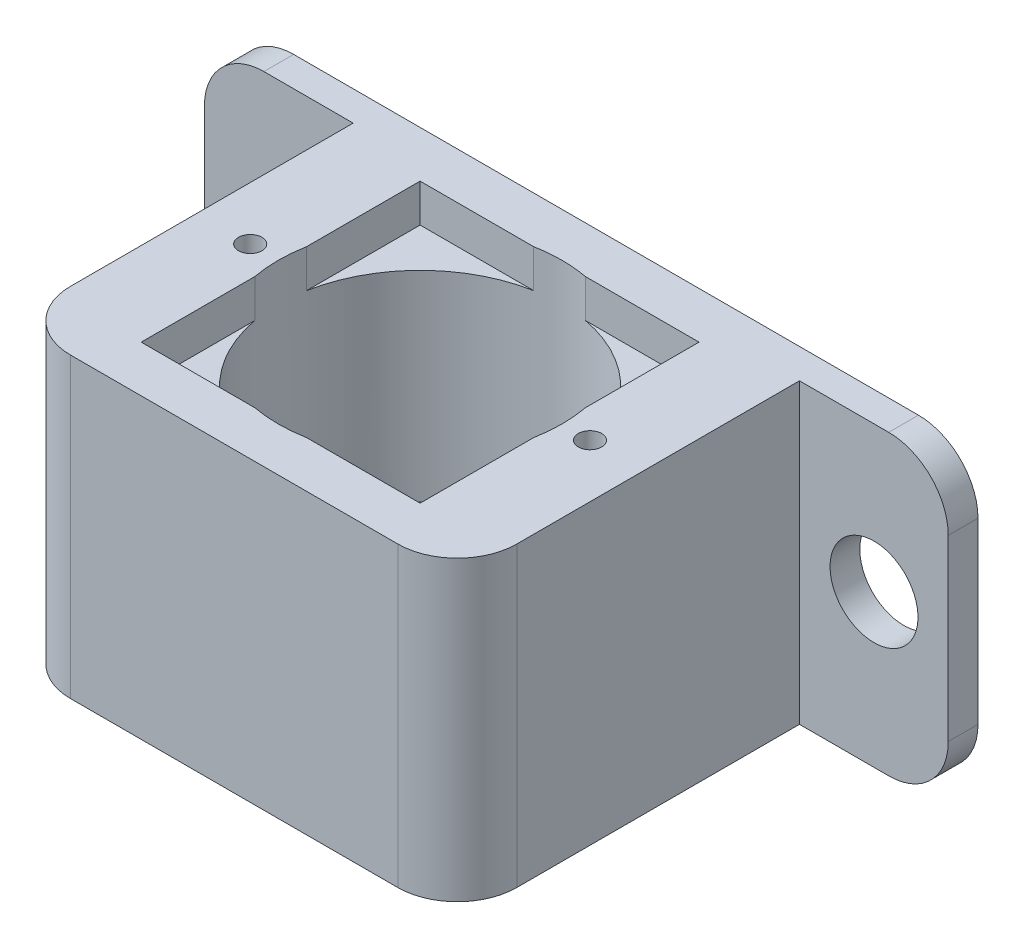
ISO-10303-21;
HEADER;
FILE_DESCRIPTION(('STEP AP214'),'2;1');
FILE_NAME('part.step','',(''),(''),'','','');
FILE_SCHEMA(('AUTOMOTIVE_DESIGN { 1 0 10303 214 1 1 1 1 }'));
ENDSEC;
DATA;
#1=APPLICATION_CONTEXT('core data for automotive mechanical design processes');
#2=APPLICATION_PROTOCOL_DEFINITION('international standard','automotive_design',2000,#1);
#3=PRODUCT_CONTEXT('',#1,'mechanical');
#4=PRODUCT('Part','Part','',(#3));
#5=PRODUCT_RELATED_PRODUCT_CATEGORY('part','',(#4));
#6=PRODUCT_DEFINITION_FORMATION('','',#4);
#7=PRODUCT_DEFINITION_CONTEXT('part definition',#1,'design');
#8=PRODUCT_DEFINITION('design','',#6,#7);
#9=PRODUCT_DEFINITION_SHAPE('','',#8);
#10=(LENGTH_UNIT() NAMED_UNIT(*) SI_UNIT(.MILLI.,.METRE.));
#11=(NAMED_UNIT(*) PLANE_ANGLE_UNIT() SI_UNIT($,.RADIAN.));
#12=(NAMED_UNIT(*) SI_UNIT($,.STERADIAN.) SOLID_ANGLE_UNIT());
#13=UNCERTAINTY_MEASURE_WITH_UNIT(LENGTH_MEASURE(1.E-05),#10,'distance_accuracy_value','');
#14=(GEOMETRIC_REPRESENTATION_CONTEXT(3) GLOBAL_UNCERTAINTY_ASSIGNED_CONTEXT((#13)) GLOBAL_UNIT_ASSIGNED_CONTEXT((#10,
#11,#12)) REPRESENTATION_CONTEXT('',''));
#15=CARTESIAN_POINT('',(0.,0.,0.));
#16=DIRECTION('',(0.,0.,1.));
#17=DIRECTION('',(1.,0.,0.));
#18=AXIS2_PLACEMENT_3D('',#15,#16,#17);
#19=CARTESIAN_POINT('',(0.,-2.54,0.));
#20=DIRECTION('',(0.,-1.,0.));
#21=DIRECTION('',(0.,0.,-1.));
#22=AXIS2_PLACEMENT_3D('',#19,#20,#21);
#23=PLANE('',#22);
#24=CARTESIAN_POINT('',(14.5034,-2.54,0.));
#25=DIRECTION('',(0.,-1.,0.));
#26=DIRECTION('',(0.,0.,-1.));
#27=AXIS2_PLACEMENT_3D('',#24,#25,#26);
#28=CIRCLE('',#27,1.);
#29=CARTESIAN_POINT('',(14.5034,-2.54,-1.));
#30=VERTEX_POINT('',#29);
#31=EDGE_CURVE('E19',#30,#30,#28,.F.);
#32=ORIENTED_EDGE('',*,*,#31,.T.);
#33=EDGE_LOOP('',(#32));
#34=FACE_BOUND('',#33,.T.);
#35=ADVANCED_FACE('F16',(#34),#23,.F.);
#36=CARTESIAN_POINT('',(0.,-2.54,0.));
#37=DIRECTION('',(0.,-1.,0.));
#38=DIRECTION('',(0.,0.,-1.));
#39=AXIS2_PLACEMENT_3D('',#36,#37,#38);
#40=PLANE('',#39);
#41=CARTESIAN_POINT('',(-14.5034,-2.54,0.));
#42=DIRECTION('',(0.,-1.,0.));
#43=DIRECTION('',(0.,0.,-1.));
#44=AXIS2_PLACEMENT_3D('',#41,#42,#43);
#45=CIRCLE('',#44,1.);
#46=CARTESIAN_POINT('',(-14.5034,-2.54,-1.));
#47=VERTEX_POINT('',#46);
#48=EDGE_CURVE('E478',#47,#47,#45,.F.);
#49=ORIENTED_EDGE('',*,*,#48,.T.);
#50=EDGE_LOOP('',(#49));
#51=FACE_BOUND('',#50,.T.);
#52=ADVANCED_FACE('F739',(#51),#40,.F.);
#53=CARTESIAN_POINT('',(-25.4129609454085,-12.4235546093226,-38.735));
#54=DIRECTION('',(0.,0.,-1.));
#55=DIRECTION('',(-1.,0.,0.));
#56=AXIS2_PLACEMENT_3D('',#53,#54,#55);
#57=CYLINDRICAL_SURFACE('',#56,3.754);
#58=CARTESIAN_POINT('',(-25.4129609454085,-12.4235546093226,-13.335));
#59=DIRECTION('',(0.,0.,-1.));
#60=DIRECTION('',(-1.,0.,0.));
#61=AXIS2_PLACEMENT_3D('',#58,#59,#60);
#62=CIRCLE('',#61,3.754);
#63=CARTESIAN_POINT('',(-29.1669609454085,-12.4235546093226,-13.335));
#64=VERTEX_POINT('',#63);
#65=EDGE_CURVE('E420',#64,#64,#62,.F.);
#66=ORIENTED_EDGE('',*,*,#65,.T.);
#67=EDGE_LOOP('',(#66));
#68=FACE_BOUND('',#67,.T.);
#69=CARTESIAN_POINT('',(-25.4129609454085,-12.4235546093226,-15.875));
#70=DIRECTION('',(0.,0.,-1.));
#71=DIRECTION('',(-1.,0.,0.));
#72=AXIS2_PLACEMENT_3D('',#69,#70,#71);
#73=CIRCLE('',#72,3.754);
#74=CARTESIAN_POINT('',(-29.1669609454085,-12.4235546093226,-15.875));
#75=VERTEX_POINT('',#74);
#76=EDGE_CURVE('E538',#75,#75,#73,.F.);
#77=ORIENTED_EDGE('',*,*,#76,.F.);
#78=EDGE_LOOP('',(#77));
#79=FACE_BOUND('',#78,.T.);
#80=ADVANCED_FACE('F733',(#68,#79),#57,.F.);
#81=CARTESIAN_POINT('',(25.4129609454085,-12.4235546093226,-38.735));
#82=DIRECTION('',(0.,0.,-1.));
#83=DIRECTION('',(-1.,0.,0.));
#84=AXIS2_PLACEMENT_3D('',#81,#82,#83);
#85=CYLINDRICAL_SURFACE('',#84,3.754);
#86=CARTESIAN_POINT('',(25.4129609454085,-12.4235546093226,-13.335));
#87=DIRECTION('',(0.,0.,-1.));
#88=DIRECTION('',(-1.,0.,0.));
#89=AXIS2_PLACEMENT_3D('',#86,#87,#88);
#90=CIRCLE('',#89,3.754);
#91=CARTESIAN_POINT('',(21.6589609454085,-12.4235546093226,-13.335));
#92=VERTEX_POINT('',#91);
#93=EDGE_CURVE('E477',#92,#92,#90,.T.);
#94=ORIENTED_EDGE('',*,*,#93,.F.);
#95=EDGE_LOOP('',(#94));
#96=FACE_BOUND('',#95,.T.);
#97=CARTESIAN_POINT('',(25.4129609454085,-12.4235546093226,-15.875));
#98=DIRECTION('',(0.,0.,-1.));
#99=DIRECTION('',(-1.,0.,0.));
#100=AXIS2_PLACEMENT_3D('',#97,#98,#99);
#101=CIRCLE('',#100,3.754);
#102=CARTESIAN_POINT('',(21.6589609454085,-12.4235546093226,-15.875));
#103=VERTEX_POINT('',#102);
#104=EDGE_CURVE('E534',#103,#103,#101,.F.);
#105=ORIENTED_EDGE('',*,*,#104,.F.);
#106=EDGE_LOOP('',(#105));
#107=FACE_BOUND('',#106,.T.);
#108=ADVANCED_FACE('F726',(#96,#107),#85,.F.);
#109=CARTESIAN_POINT('',(-31.75,-12.7,0.));
#110=DIRECTION('',(-1.,0.,0.));
#111=DIRECTION('',(0.,0.,1.));
#112=AXIS2_PLACEMENT_3D('',#109,#110,#111);
#113=PLANE('',#112);
#114=DIRECTION('',(0.,1.,0.));
#115=VECTOR('',#114,1.);
#116=CARTESIAN_POINT('',(-31.75,-12.7,-13.335));
#117=LINE('',#116,#115);
#118=CARTESIAN_POINT('',(-31.75,-20.32,-13.335));
#119=VERTEX_POINT('',#118);
#120=CARTESIAN_POINT('',(-31.75,-5.08,-13.335));
#121=VERTEX_POINT('',#120);
#122=EDGE_CURVE('E411',#119,#121,#117,.T.);
#123=ORIENTED_EDGE('',*,*,#122,.T.);
#124=DIRECTION('',(0.,0.,1.));
#125=VECTOR('',#124,1.);
#126=CARTESIAN_POINT('',(-31.75,-5.08,0.));
#127=LINE('',#126,#125);
#128=CARTESIAN_POINT('',(-31.75,-5.08,-15.875));
#129=VERTEX_POINT('',#128);
#130=EDGE_CURVE('E415',#129,#121,#127,.T.);
#131=ORIENTED_EDGE('',*,*,#130,.F.);
#132=DIRECTION('',(0.,1.,0.));
#133=VECTOR('',#132,1.);
#134=CARTESIAN_POINT('',(-31.75,-25.4,-15.875));
#135=LINE('',#134,#133);
#136=CARTESIAN_POINT('',(-31.75,-20.32,-15.875));
#137=VERTEX_POINT('',#136);
#138=EDGE_CURVE('E389',#137,#129,#135,.T.);
#139=ORIENTED_EDGE('',*,*,#138,.F.);
#140=DIRECTION('',(0.,0.,-1.));
#141=VECTOR('',#140,1.);
#142=CARTESIAN_POINT('',(-31.75,-20.32,0.));
#143=LINE('',#142,#141);
#144=EDGE_CURVE('E473',#119,#137,#143,.T.);
#145=ORIENTED_EDGE('',*,*,#144,.F.);
#146=EDGE_LOOP('',(#123,#131,#139,#145));
#147=FACE_BOUND('',#146,.T.);
#148=ADVANCED_FACE('F724',(#147),#113,.T.);
#149=CARTESIAN_POINT('',(31.75,-12.7,0.));
#150=DIRECTION('',(1.,0.,0.));
#151=DIRECTION('',(0.,0.,-1.));
#152=AXIS2_PLACEMENT_3D('',#149,#150,#151);
#153=PLANE('',#152);
#154=DIRECTION('',(0.,1.,0.));
#155=VECTOR('',#154,1.);
#156=CARTESIAN_POINT('',(31.75,-25.4,-15.875));
#157=LINE('',#156,#155);
#158=CARTESIAN_POINT('',(31.75,-5.08,-15.875));
#159=VERTEX_POINT('',#158);
#160=CARTESIAN_POINT('',(31.75,-20.32,-15.875));
#161=VERTEX_POINT('',#160);
#162=EDGE_CURVE('E384',#159,#161,#157,.F.);
#163=ORIENTED_EDGE('',*,*,#162,.F.);
#164=DIRECTION('',(0.,0.,1.));
#165=VECTOR('',#164,1.);
#166=CARTESIAN_POINT('',(31.75,-5.08,0.));
#167=LINE('',#166,#165);
#168=CARTESIAN_POINT('',(31.75,-5.08,-13.335));
#169=VERTEX_POINT('',#168);
#170=EDGE_CURVE('E474',#169,#159,#167,.F.);
#171=ORIENTED_EDGE('',*,*,#170,.F.);
#172=DIRECTION('',(0.,1.,0.));
#173=VECTOR('',#172,1.);
#174=CARTESIAN_POINT('',(31.75,-12.7,-13.335));
#175=LINE('',#174,#173);
#176=CARTESIAN_POINT('',(31.75,-20.32,-13.335));
#177=VERTEX_POINT('',#176);
#178=EDGE_CURVE('E447',#177,#169,#175,.T.);
#179=ORIENTED_EDGE('',*,*,#178,.F.);
#180=DIRECTION('',(0.,0.,-1.));
#181=VECTOR('',#180,1.);
#182=CARTESIAN_POINT('',(31.75,-20.32,0.));
#183=LINE('',#182,#181);
#184=EDGE_CURVE('E469',#161,#177,#183,.F.);
#185=ORIENTED_EDGE('',*,*,#184,.F.);
#186=EDGE_LOOP('',(#163,#171,#179,#185));
#187=FACE_BOUND('',#186,.T.);
#188=ADVANCED_FACE('F700',(#187),#153,.T.);
#189=CARTESIAN_POINT('',(-26.67,-20.32,0.));
#190=DIRECTION('',(0.,0.,-1.));
#191=DIRECTION('',(-1.,0.,0.));
#192=AXIS2_PLACEMENT_3D('',#189,#190,#191);
#193=CYLINDRICAL_SURFACE('',#192,5.08);
#194=CARTESIAN_POINT('',(-26.67,-20.32,-13.335));
#195=DIRECTION('',(0.,0.,-1.));
#196=DIRECTION('',(-1.,0.,0.));
#197=AXIS2_PLACEMENT_3D('',#194,#195,#196);
#198=CIRCLE('',#197,5.08);
#199=CARTESIAN_POINT('',(-26.67,-25.4,-13.335));
#200=VERTEX_POINT('',#199);
#201=EDGE_CURVE('E416',#200,#119,#198,.T.);
#202=ORIENTED_EDGE('',*,*,#201,.T.);
#203=ORIENTED_EDGE('',*,*,#144,.T.);
#204=CARTESIAN_POINT('',(-26.67,-20.32,-15.875));
#205=DIRECTION('',(0.,0.,-1.));
#206=DIRECTION('',(-1.,0.,0.));
#207=AXIS2_PLACEMENT_3D('',#204,#205,#206);
#208=CIRCLE('',#207,5.08);
#209=CARTESIAN_POINT('',(-26.67,-25.4,-15.875));
#210=VERTEX_POINT('',#209);
#211=EDGE_CURVE('E393',#210,#137,#208,.T.);
#212=ORIENTED_EDGE('',*,*,#211,.F.);
#213=DIRECTION('',(0.,0.,-1.));
#214=VECTOR('',#213,1.);
#215=CARTESIAN_POINT('',(-26.67,-25.4,0.));
#216=LINE('',#215,#214);
#217=EDGE_CURVE('E455',#200,#210,#216,.T.);
#218=ORIENTED_EDGE('',*,*,#217,.F.);
#219=EDGE_LOOP('',(#202,#203,#212,#218));
#220=FACE_BOUND('',#219,.T.);
#221=ADVANCED_FACE('F580',(#220),#193,.T.);
#222=CARTESIAN_POINT('',(26.67,-20.32,0.));
#223=DIRECTION('',(0.,0.,-1.));
#224=DIRECTION('',(-1.,0.,0.));
#225=AXIS2_PLACEMENT_3D('',#222,#223,#224);
#226=CYLINDRICAL_SURFACE('',#225,5.08);
#227=CARTESIAN_POINT('',(26.67,-20.32,-13.335));
#228=DIRECTION('',(0.,0.,-1.));
#229=DIRECTION('',(-1.,0.,0.));
#230=AXIS2_PLACEMENT_3D('',#227,#228,#229);
#231=CIRCLE('',#230,5.08);
#232=CARTESIAN_POINT('',(26.67,-25.4,-13.335));
#233=VERTEX_POINT('',#232);
#234=EDGE_CURVE('E450',#233,#177,#231,.F.);
#235=ORIENTED_EDGE('',*,*,#234,.F.);
#236=DIRECTION('',(0.,0.,-1.));
#237=VECTOR('',#236,1.);
#238=CARTESIAN_POINT('',(26.67,-25.4,0.));
#239=LINE('',#238,#237);
#240=CARTESIAN_POINT('',(26.67,-25.4,-15.875));
#241=VERTEX_POINT('',#240);
#242=EDGE_CURVE('E162',#241,#233,#239,.F.);
#243=ORIENTED_EDGE('',*,*,#242,.F.);
#244=CARTESIAN_POINT('',(26.67,-20.32,-15.875));
#245=DIRECTION('',(0.,0.,-1.));
#246=DIRECTION('',(-1.,0.,0.));
#247=AXIS2_PLACEMENT_3D('',#244,#245,#246);
#248=CIRCLE('',#247,5.08);
#249=EDGE_CURVE('E387',#161,#241,#248,.T.);
#250=ORIENTED_EDGE('',*,*,#249,.F.);
#251=ORIENTED_EDGE('',*,*,#184,.T.);
#252=EDGE_LOOP('',(#235,#243,#250,#251));
#253=FACE_BOUND('',#252,.T.);
#254=ADVANCED_FACE('F569',(#253),#226,.T.);
#255=CARTESIAN_POINT('',(14.5034,-2.54,0.));
#256=DIRECTION('',(0.,-1.,0.));
#257=DIRECTION('',(0.,0.,-1.));
#258=AXIS2_PLACEMENT_3D('',#255,#256,#257);
#259=CYLINDRICAL_SURFACE('',#258,1.);
#260=CARTESIAN_POINT('',(14.5034,0.,0.));
#261=DIRECTION('',(0.,-1.,0.));
#262=DIRECTION('',(0.,0.,-1.));
#263=AXIS2_PLACEMENT_3D('',#260,#261,#262);
#264=CIRCLE('',#263,1.);
#265=CARTESIAN_POINT('',(14.5034,0.,-1.));
#266=VERTEX_POINT('',#265);
#267=EDGE_CURVE('E296',#266,#266,#264,.F.);
#268=ORIENTED_EDGE('',*,*,#267,.T.);
#269=EDGE_LOOP('',(#268));
#270=FACE_BOUND('',#269,.T.);
#271=ORIENTED_EDGE('',*,*,#31,.F.);
#272=EDGE_LOOP('',(#271));
#273=FACE_BOUND('',#272,.T.);
#274=ADVANCED_FACE('F566',(#270,#273),#259,.F.);
#275=CARTESIAN_POINT('',(-14.5034,-2.54,0.));
#276=DIRECTION('',(0.,-1.,0.));
#277=DIRECTION('',(0.,0.,-1.));
#278=AXIS2_PLACEMENT_3D('',#275,#276,#277);
#279=CYLINDRICAL_SURFACE('',#278,1.);
#280=CARTESIAN_POINT('',(-14.5034,0.,0.));
#281=DIRECTION('',(0.,-1.,0.));
#282=DIRECTION('',(0.,0.,-1.));
#283=AXIS2_PLACEMENT_3D('',#280,#281,#282);
#284=CIRCLE('',#283,1.);
#285=CARTESIAN_POINT('',(-14.5034,0.,-1.));
#286=VERTEX_POINT('',#285);
#287=EDGE_CURVE('E405',#286,#286,#284,.F.);
#288=ORIENTED_EDGE('',*,*,#287,.T.);
#289=EDGE_LOOP('',(#288));
#290=FACE_BOUND('',#289,.T.);
#291=ORIENTED_EDGE('',*,*,#48,.F.);
#292=EDGE_LOOP('',(#291));
#293=FACE_BOUND('',#292,.T.);
#294=ADVANCED_FACE('F568',(#290,#293),#279,.F.);
#295=CARTESIAN_POINT('',(26.67,-5.08,0.));
#296=DIRECTION('',(0.,0.,1.));
#297=DIRECTION('',(1.,0.,0.));
#298=AXIS2_PLACEMENT_3D('',#295,#296,#297);
#299=CYLINDRICAL_SURFACE('',#298,5.08);
#300=CARTESIAN_POINT('',(26.67,-5.08,-13.335));
#301=DIRECTION('',(0.,0.,1.));
#302=DIRECTION('',(1.,0.,0.));
#303=AXIS2_PLACEMENT_3D('',#300,#301,#302);
#304=CIRCLE('',#303,5.08);
#305=CARTESIAN_POINT('',(26.67,0.,-13.335));
#306=VERTEX_POINT('',#305);
#307=EDGE_CURVE('E439',#169,#306,#304,.T.);
#308=ORIENTED_EDGE('',*,*,#307,.F.);
#309=ORIENTED_EDGE('',*,*,#170,.T.);
#310=CARTESIAN_POINT('',(26.67,-5.08,-15.875));
#311=DIRECTION('',(0.,0.,1.));
#312=DIRECTION('',(1.,0.,0.));
#313=AXIS2_PLACEMENT_3D('',#310,#311,#312);
#314=CIRCLE('',#313,5.08);
#315=CARTESIAN_POINT('',(26.67,0.,-15.875));
#316=VERTEX_POINT('',#315);
#317=EDGE_CURVE('E388',#316,#159,#314,.F.);
#318=ORIENTED_EDGE('',*,*,#317,.F.);
#319=DIRECTION('',(0.,0.,-1.));
#320=VECTOR('',#319,1.);
#321=CARTESIAN_POINT('',(26.67,0.,0.));
#322=LINE('',#321,#320);
#323=EDGE_CURVE('E401',#316,#306,#322,.F.);
#324=ORIENTED_EDGE('',*,*,#323,.T.);
#325=EDGE_LOOP('',(#308,#309,#318,#324));
#326=FACE_BOUND('',#325,.T.);
#327=ADVANCED_FACE('F577',(#326),#299,.T.);
#328=CARTESIAN_POINT('',(31.75,-12.7,-13.335));
#329=DIRECTION('',(0.,0.,1.));
#330=DIRECTION('',(1.,0.,0.));
#331=AXIS2_PLACEMENT_3D('',#328,#329,#330);
#332=PLANE('',#331);
#333=DIRECTION('',(1.,0.,0.));
#334=VECTOR('',#333,1.);
#335=CARTESIAN_POINT('',(0.,0.,-13.335));
#336=LINE('',#335,#334);
#337=CARTESIAN_POINT('',(19.05,0.,-13.335));
#338=VERTEX_POINT('',#337);
#339=EDGE_CURVE('E285',#306,#338,#336,.F.);
#340=ORIENTED_EDGE('',*,*,#339,.T.);
#341=DIRECTION('',(0.,1.,0.));
#342=VECTOR('',#341,1.);
#343=CARTESIAN_POINT('',(19.05,-25.4,-13.335));
#344=LINE('',#343,#342);
#345=CARTESIAN_POINT('',(19.05,-25.4,-13.335));
#346=VERTEX_POINT('',#345);
#347=EDGE_CURVE('E436',#338,#346,#344,.F.);
#348=ORIENTED_EDGE('',*,*,#347,.T.);
#349=DIRECTION('',(1.,0.,0.));
#350=VECTOR('',#349,1.);
#351=CARTESIAN_POINT('',(0.,-25.4,-13.335));
#352=LINE('',#351,#350);
#353=EDGE_CURVE('E165',#233,#346,#352,.F.);
#354=ORIENTED_EDGE('',*,*,#353,.F.);
#355=ORIENTED_EDGE('',*,*,#234,.T.);
#356=ORIENTED_EDGE('',*,*,#178,.T.);
#357=ORIENTED_EDGE('',*,*,#307,.T.);
#358=EDGE_LOOP('',(#340,#348,#354,#355,#356,#357));
#359=FACE_BOUND('',#358,.T.);
#360=ORIENTED_EDGE('',*,*,#93,.T.);
#361=EDGE_LOOP('',(#360));
#362=FACE_BOUND('',#361,.T.);
#363=ADVANCED_FACE('F671',(#359,#362),#332,.T.);
#364=CARTESIAN_POINT('',(19.05,-25.4,0.));
#365=DIRECTION('',(-1.,0.,0.));
#366=DIRECTION('',(0.,0.,1.));
#367=AXIS2_PLACEMENT_3D('',#364,#365,#366);
#368=PLANE('',#367);
#369=DIRECTION('',(0.,-1.,0.));
#370=VECTOR('',#369,1.);
#371=CARTESIAN_POINT('',(19.05,-25.4,10.795));
#372=LINE('',#371,#370);
#373=CARTESIAN_POINT('',(19.05,-25.4,10.795));
#374=VERTEX_POINT('',#373);
#375=CARTESIAN_POINT('',(19.05,0.,10.795));
#376=VERTEX_POINT('',#375);
#377=EDGE_CURVE('E433',#374,#376,#372,.F.);
#378=ORIENTED_EDGE('',*,*,#377,.F.);
#379=DIRECTION('',(0.,0.,-1.));
#380=VECTOR('',#379,1.);
#381=CARTESIAN_POINT('',(19.05,-25.4,0.));
#382=LINE('',#381,#380);
#383=EDGE_CURVE('E365',#346,#374,#382,.F.);
#384=ORIENTED_EDGE('',*,*,#383,.F.);
#385=ORIENTED_EDGE('',*,*,#347,.F.);
#386=DIRECTION('',(0.,0.,-1.));
#387=VECTOR('',#386,1.);
#388=CARTESIAN_POINT('',(19.05,0.,0.));
#389=LINE('',#388,#387);
#390=EDGE_CURVE('E281',#338,#376,#389,.F.);
#391=ORIENTED_EDGE('',*,*,#390,.T.);
#392=EDGE_LOOP('',(#378,#384,#385,#391));
#393=FACE_BOUND('',#392,.T.);
#394=ADVANCED_FACE('F667',(#393),#368,.F.);
#395=CARTESIAN_POINT('',(13.97,-25.4,10.795));
#396=DIRECTION('',(0.,-1.,0.));
#397=DIRECTION('',(0.,0.,-1.));
#398=AXIS2_PLACEMENT_3D('',#395,#396,#397);
#399=CYLINDRICAL_SURFACE('',#398,5.08);
#400=CARTESIAN_POINT('',(13.97,0.,10.795));
#401=DIRECTION('',(0.,-1.,0.));
#402=DIRECTION('',(0.,0.,-1.));
#403=AXIS2_PLACEMENT_3D('',#400,#401,#402);
#404=CIRCLE('',#403,5.08);
#405=CARTESIAN_POINT('',(13.97,0.,15.875));
#406=VERTEX_POINT('',#405);
#407=EDGE_CURVE('E280',#376,#406,#404,.T.);
#408=ORIENTED_EDGE('',*,*,#407,.T.);
#409=DIRECTION('',(0.,1.,0.));
#410=VECTOR('',#409,1.);
#411=CARTESIAN_POINT('',(13.97,-25.4,15.875));
#412=LINE('',#411,#410);
#413=CARTESIAN_POINT('',(13.97,-25.4,15.875));
#414=VERTEX_POINT('',#413);
#415=EDGE_CURVE('E429',#406,#414,#412,.F.);
#416=ORIENTED_EDGE('',*,*,#415,.T.);
#417=CARTESIAN_POINT('',(13.97,-25.4,10.795));
#418=DIRECTION('',(0.,-1.,0.));
#419=DIRECTION('',(0.,0.,-1.));
#420=AXIS2_PLACEMENT_3D('',#417,#418,#419);
#421=CIRCLE('',#420,5.08);
#422=EDGE_CURVE('E364',#374,#414,#421,.T.);
#423=ORIENTED_EDGE('',*,*,#422,.F.);
#424=ORIENTED_EDGE('',*,*,#377,.T.);
#425=EDGE_LOOP('',(#408,#416,#423,#424));
#426=FACE_BOUND('',#425,.T.);
#427=ADVANCED_FACE('F663',(#426),#399,.T.);
#428=CARTESIAN_POINT('',(0.,-25.4,15.875));
#429=DIRECTION('',(0.,0.,-1.));
#430=DIRECTION('',(-1.,0.,0.));
#431=AXIS2_PLACEMENT_3D('',#428,#429,#430);
#432=PLANE('',#431);
#433=ORIENTED_EDGE('',*,*,#415,.F.);
#434=DIRECTION('',(1.,0.,0.));
#435=VECTOR('',#434,1.);
#436=CARTESIAN_POINT('',(0.,0.,15.875));
#437=LINE('',#436,#435);
#438=CARTESIAN_POINT('',(-13.97,0.,15.875));
#439=VERTEX_POINT('',#438);
#440=EDGE_CURVE('E276',#406,#439,#437,.F.);
#441=ORIENTED_EDGE('',*,*,#440,.T.);
#442=DIRECTION('',(0.,1.,0.));
#443=VECTOR('',#442,1.);
#444=CARTESIAN_POINT('',(-13.97,-25.4,15.875));
#445=LINE('',#444,#443);
#446=CARTESIAN_POINT('',(-13.97,-25.4,15.875));
#447=VERTEX_POINT('',#446);
#448=EDGE_CURVE('E426',#447,#439,#445,.T.);
#449=ORIENTED_EDGE('',*,*,#448,.F.);
#450=DIRECTION('',(1.,0.,0.));
#451=VECTOR('',#450,1.);
#452=CARTESIAN_POINT('',(0.,-25.4,15.875));
#453=LINE('',#452,#451);
#454=EDGE_CURVE('E361',#414,#447,#453,.F.);
#455=ORIENTED_EDGE('',*,*,#454,.F.);
#456=EDGE_LOOP('',(#433,#441,#449,#455));
#457=FACE_BOUND('',#456,.T.);
#458=ADVANCED_FACE('F659',(#457),#432,.F.);
#459=CARTESIAN_POINT('',(-13.97,-25.4,10.795));
#460=DIRECTION('',(0.,1.,0.));
#461=DIRECTION('',(0.,0.,1.));
#462=AXIS2_PLACEMENT_3D('',#459,#460,#461);
#463=CYLINDRICAL_SURFACE('',#462,5.08);
#464=CARTESIAN_POINT('',(-13.97,0.,10.795));
#465=DIRECTION('',(0.,1.,0.));
#466=DIRECTION('',(0.,0.,1.));
#467=AXIS2_PLACEMENT_3D('',#464,#465,#466);
#468=CIRCLE('',#467,5.08);
#469=CARTESIAN_POINT('',(-19.05,0.,10.795));
#470=VERTEX_POINT('',#469);
#471=EDGE_CURVE('E273',#439,#470,#468,.F.);
#472=ORIENTED_EDGE('',*,*,#471,.T.);
#473=DIRECTION('',(0.,1.,0.));
#474=VECTOR('',#473,1.);
#475=CARTESIAN_POINT('',(-19.05,-25.4,10.795));
#476=LINE('',#475,#474);
#477=CARTESIAN_POINT('',(-19.05,-25.4,10.795));
#478=VERTEX_POINT('',#477);
#479=EDGE_CURVE('E423',#478,#470,#476,.T.);
#480=ORIENTED_EDGE('',*,*,#479,.F.);
#481=CARTESIAN_POINT('',(-13.97,-25.4,10.795));
#482=DIRECTION('',(0.,1.,0.));
#483=DIRECTION('',(0.,0.,1.));
#484=AXIS2_PLACEMENT_3D('',#481,#482,#483);
#485=CIRCLE('',#484,5.08);
#486=EDGE_CURVE('E358',#447,#478,#485,.F.);
#487=ORIENTED_EDGE('',*,*,#486,.F.);
#488=ORIENTED_EDGE('',*,*,#448,.T.);
#489=EDGE_LOOP('',(#472,#480,#487,#488));
#490=FACE_BOUND('',#489,.T.);
#491=ADVANCED_FACE('F655',(#490),#463,.T.);
#492=CARTESIAN_POINT('',(-19.05,-25.4,0.));
#493=DIRECTION('',(-1.,0.,0.));
#494=DIRECTION('',(0.,0.,1.));
#495=AXIS2_PLACEMENT_3D('',#492,#493,#494);
#496=PLANE('',#495);
#497=DIRECTION('',(0.,0.,-1.));
#498=VECTOR('',#497,1.);
#499=CARTESIAN_POINT('',(-19.05,0.,0.));
#500=LINE('',#499,#498);
#501=CARTESIAN_POINT('',(-19.05,0.,-13.335));
#502=VERTEX_POINT('',#501);
#503=EDGE_CURVE('E268',#470,#502,#500,.T.);
#504=ORIENTED_EDGE('',*,*,#503,.T.);
#505=DIRECTION('',(0.,1.,0.));
#506=VECTOR('',#505,1.);
#507=CARTESIAN_POINT('',(-19.05,-12.7,-13.335));
#508=LINE('',#507,#506);
#509=CARTESIAN_POINT('',(-19.05,-25.4,-13.335));
#510=VERTEX_POINT('',#509);
#511=EDGE_CURVE('E417',#502,#510,#508,.F.);
#512=ORIENTED_EDGE('',*,*,#511,.T.);
#513=DIRECTION('',(0.,0.,-1.));
#514=VECTOR('',#513,1.);
#515=CARTESIAN_POINT('',(-19.05,-25.4,0.));
#516=LINE('',#515,#514);
#517=EDGE_CURVE('E348',#478,#510,#516,.T.);
#518=ORIENTED_EDGE('',*,*,#517,.F.);
#519=ORIENTED_EDGE('',*,*,#479,.T.);
#520=EDGE_LOOP('',(#504,#512,#518,#519));
#521=FACE_BOUND('',#520,.T.);
#522=ADVANCED_FACE('F651',(#521),#496,.T.);
#523=CARTESIAN_POINT('',(-31.75,-12.7,-13.335));
#524=DIRECTION('',(0.,0.,-1.));
#525=DIRECTION('',(-1.,0.,0.));
#526=AXIS2_PLACEMENT_3D('',#523,#524,#525);
#527=PLANE('',#526);
#528=ORIENTED_EDGE('',*,*,#201,.F.);
#529=DIRECTION('',(1.,0.,0.));
#530=VECTOR('',#529,1.);
#531=CARTESIAN_POINT('',(0.,-25.4,-13.335));
#532=LINE('',#531,#530);
#533=EDGE_CURVE('E451',#510,#200,#532,.F.);
#534=ORIENTED_EDGE('',*,*,#533,.F.);
#535=ORIENTED_EDGE('',*,*,#511,.F.);
#536=DIRECTION('',(1.,0.,0.));
#537=VECTOR('',#536,1.);
#538=CARTESIAN_POINT('',(0.,0.,-13.335));
#539=LINE('',#538,#537);
#540=CARTESIAN_POINT('',(-26.67,0.,-13.335));
#541=VERTEX_POINT('',#540);
#542=EDGE_CURVE('E272',#502,#541,#539,.F.);
#543=ORIENTED_EDGE('',*,*,#542,.T.);
#544=CARTESIAN_POINT('',(-26.67,-5.08,-13.335));
#545=DIRECTION('',(0.,0.,1.));
#546=DIRECTION('',(1.,0.,0.));
#547=AXIS2_PLACEMENT_3D('',#544,#545,#546);
#548=CIRCLE('',#547,5.08);
#549=EDGE_CURVE('E481',#121,#541,#548,.F.);
#550=ORIENTED_EDGE('',*,*,#549,.F.);
#551=ORIENTED_EDGE('',*,*,#122,.F.);
#552=EDGE_LOOP('',(#528,#534,#535,#543,#550,#551));
#553=FACE_BOUND('',#552,.T.);
#554=ORIENTED_EDGE('',*,*,#65,.F.);
#555=EDGE_LOOP('',(#554));
#556=FACE_BOUND('',#555,.T.);
#557=ADVANCED_FACE('F647',(#553,#556),#527,.F.);
#558=CARTESIAN_POINT('',(-26.67,-5.08,0.));
#559=DIRECTION('',(0.,0.,1.));
#560=DIRECTION('',(1.,0.,0.));
#561=AXIS2_PLACEMENT_3D('',#558,#559,#560);
#562=CYLINDRICAL_SURFACE('',#561,5.08);
#563=ORIENTED_EDGE('',*,*,#549,.T.);
#564=DIRECTION('',(0.,0.,-1.));
#565=VECTOR('',#564,1.);
#566=CARTESIAN_POINT('',(-26.67,0.,0.));
#567=LINE('',#566,#565);
#568=CARTESIAN_POINT('',(-26.67,0.,-15.875));
#569=VERTEX_POINT('',#568);
#570=EDGE_CURVE('E394',#541,#569,#567,.T.);
#571=ORIENTED_EDGE('',*,*,#570,.T.);
#572=CARTESIAN_POINT('',(-26.67,-5.08,-15.875));
#573=DIRECTION('',(0.,0.,1.));
#574=DIRECTION('',(1.,0.,0.));
#575=AXIS2_PLACEMENT_3D('',#572,#573,#574);
#576=CIRCLE('',#575,5.08);
#577=EDGE_CURVE('E392',#129,#569,#576,.F.);
#578=ORIENTED_EDGE('',*,*,#577,.F.);
#579=ORIENTED_EDGE('',*,*,#130,.T.);
#580=EDGE_LOOP('',(#563,#571,#578,#579));
#581=FACE_BOUND('',#580,.T.);
#582=ADVANCED_FACE('F643',(#581),#562,.T.);
#583=CARTESIAN_POINT('',(0.,-25.4,-15.875));
#584=DIRECTION('',(0.,0.,-1.));
#585=DIRECTION('',(-1.,0.,0.));
#586=AXIS2_PLACEMENT_3D('',#583,#584,#585);
#587=PLANE('',#586);
#588=ORIENTED_EDGE('',*,*,#162,.T.);
#589=ORIENTED_EDGE('',*,*,#249,.T.);
#590=DIRECTION('',(1.,0.,0.));
#591=VECTOR('',#590,1.);
#592=CARTESIAN_POINT('',(0.,-25.4,-15.875));
#593=LINE('',#592,#591);
#594=EDGE_CURVE('E464',#210,#241,#593,.T.);
#595=ORIENTED_EDGE('',*,*,#594,.F.);
#596=ORIENTED_EDGE('',*,*,#211,.T.);
#597=ORIENTED_EDGE('',*,*,#138,.T.);
#598=ORIENTED_EDGE('',*,*,#577,.T.);
#599=DIRECTION('',(1.,0.,0.));
#600=VECTOR('',#599,1.);
#601=CARTESIAN_POINT('',(0.,0.,-15.875));
#602=LINE('',#601,#600);
#603=EDGE_CURVE('E265',#569,#316,#602,.T.);
#604=ORIENTED_EDGE('',*,*,#603,.T.);
#605=ORIENTED_EDGE('',*,*,#317,.T.);
#606=EDGE_LOOP('',(#588,#589,#595,#596,#597,#598,#604,#605));
#607=FACE_BOUND('',#606,.T.);
#608=ORIENTED_EDGE('',*,*,#104,.T.);
#609=EDGE_LOOP('',(#608));
#610=FACE_BOUND('',#609,.T.);
#611=ORIENTED_EDGE('',*,*,#76,.T.);
#612=EDGE_LOOP('',(#611));
#613=FACE_BOUND('',#612,.T.);
#614=ADVANCED_FACE('F640',(#607,#610,#613),#587,.T.);
#615=CARTESIAN_POINT('',(0.,-25.4,0.));
#616=DIRECTION('',(0.,-1.,0.));
#617=DIRECTION('',(0.,0.,-1.));
#618=AXIS2_PLACEMENT_3D('',#615,#616,#617);
#619=PLANE('',#618);
#620=ORIENTED_EDGE('',*,*,#486,.T.);
#621=ORIENTED_EDGE('',*,*,#517,.T.);
#622=ORIENTED_EDGE('',*,*,#533,.T.);
#623=ORIENTED_EDGE('',*,*,#217,.T.);
#624=ORIENTED_EDGE('',*,*,#594,.T.);
#625=ORIENTED_EDGE('',*,*,#242,.T.);
#626=ORIENTED_EDGE('',*,*,#353,.T.);
#627=ORIENTED_EDGE('',*,*,#383,.T.);
#628=ORIENTED_EDGE('',*,*,#422,.T.);
#629=ORIENTED_EDGE('',*,*,#454,.T.);
#630=EDGE_LOOP('',(#620,#621,#622,#623,#624,#625,#626,#627,#628,#629));
#631=FACE_BOUND('',#630,.T.);
#632=CARTESIAN_POINT('',(0.,-25.4,0.));
#633=DIRECTION('',(0.,-1.,0.));
#634=DIRECTION('',(0.,0.,-1.));
#635=AXIS2_PLACEMENT_3D('',#632,#633,#634);
#636=CIRCLE('',#635,12.108);
#637=CARTESIAN_POINT('',(0.,-25.4,-12.108));
#638=VERTEX_POINT('',#637);
#639=EDGE_CURVE('E207',#638,#638,#636,.F.);
#640=ORIENTED_EDGE('',*,*,#639,.T.);
#641=EDGE_LOOP('',(#640));
#642=FACE_BOUND('',#641,.T.);
#643=ADVANCED_FACE('F637',(#631,#642),#619,.T.);
#644=CARTESIAN_POINT('',(11.9048003107309,-3.25,0.));
#645=DIRECTION('',(-1.,0.,0.));
#646=DIRECTION('',(0.,0.,1.));
#647=AXIS2_PLACEMENT_3D('',#644,#645,#646);
#648=PLANE('',#647);
#649=DIRECTION('',(0.,0.,-1.));
#650=VECTOR('',#649,1.);
#651=CARTESIAN_POINT('',(11.9048003107309,-3.25,0.));
#652=LINE('',#651,#650);
#653=CARTESIAN_POINT('',(11.9048003107309,-3.25,-11.9048003107309));
#654=VERTEX_POINT('',#653);
#655=CARTESIAN_POINT('',(11.9048003107309,-3.25,-2.20893493829516));
#656=VERTEX_POINT('',#655);
#657=EDGE_CURVE('E197',#654,#656,#652,.F.);
#658=ORIENTED_EDGE('',*,*,#657,.T.);
#659=DIRECTION('',(0.,-1.,0.));
#660=VECTOR('',#659,1.);
#661=CARTESIAN_POINT('',(11.9048003107309,-25.4,-2.20893493829507));
#662=LINE('',#661,#660);
#663=CARTESIAN_POINT('',(11.9048003107309,0.,-2.20893493829516));
#664=VERTEX_POINT('',#663);
#665=EDGE_CURVE('E225',#656,#664,#662,.F.);
#666=ORIENTED_EDGE('',*,*,#665,.T.);
#667=DIRECTION('',(0.,0.,-1.));
#668=VECTOR('',#667,1.);
#669=CARTESIAN_POINT('',(11.9048003107309,0.,0.));
#670=LINE('',#669,#668);
#671=CARTESIAN_POINT('',(11.9048003107309,0.,-11.9048003107309));
#672=VERTEX_POINT('',#671);
#673=EDGE_CURVE('E198',#664,#672,#670,.T.);
#674=ORIENTED_EDGE('',*,*,#673,.T.);
#675=DIRECTION('',(0.,1.,0.));
#676=VECTOR('',#675,1.);
#677=CARTESIAN_POINT('',(11.9048003107309,-3.25,-11.9048003107309));
#678=LINE('',#677,#676);
#679=EDGE_CURVE('E194',#654,#672,#678,.T.);
#680=ORIENTED_EDGE('',*,*,#679,.F.);
#681=EDGE_LOOP('',(#658,#666,#674,#680));
#682=FACE_BOUND('',#681,.T.);
#683=ADVANCED_FACE('F195',(#682),#648,.T.);
#684=CARTESIAN_POINT('',(11.9048003107309,-3.25,0.));
#685=DIRECTION('',(-1.,0.,0.));
#686=DIRECTION('',(0.,0.,1.));
#687=AXIS2_PLACEMENT_3D('',#684,#685,#686);
#688=PLANE('',#687);
#689=DIRECTION('',(0.,0.,-1.));
#690=VECTOR('',#689,1.);
#691=CARTESIAN_POINT('',(11.9048003107309,0.,0.));
#692=LINE('',#691,#690);
#693=CARTESIAN_POINT('',(11.9048003107309,0.,11.9048003107309));
#694=VERTEX_POINT('',#693);
#695=CARTESIAN_POINT('',(11.9048003107309,0.,2.20893493829516));
#696=VERTEX_POINT('',#695);
#697=EDGE_CURVE('E243',#694,#696,#692,.T.);
#698=ORIENTED_EDGE('',*,*,#697,.T.);
#699=DIRECTION('',(0.,-1.,0.));
#700=VECTOR('',#699,1.);
#701=CARTESIAN_POINT('',(11.9048003107309,-25.4,2.20893493829507));
#702=LINE('',#701,#700);
#703=CARTESIAN_POINT('',(11.9048003107309,-3.25,2.20893493829516));
#704=VERTEX_POINT('',#703);
#705=EDGE_CURVE('E351',#696,#704,#702,.T.);
#706=ORIENTED_EDGE('',*,*,#705,.T.);
#707=DIRECTION('',(0.,0.,-1.));
#708=VECTOR('',#707,1.);
#709=CARTESIAN_POINT('',(11.9048003107309,-3.25,0.));
#710=LINE('',#709,#708);
#711=CARTESIAN_POINT('',(11.9048003107309,-3.25,11.9048003107309));
#712=VERTEX_POINT('',#711);
#713=EDGE_CURVE('E343',#704,#712,#710,.F.);
#714=ORIENTED_EDGE('',*,*,#713,.T.);
#715=DIRECTION('',(0.,1.,0.));
#716=VECTOR('',#715,1.);
#717=CARTESIAN_POINT('',(11.9048003107309,-3.25,11.9048003107309));
#718=LINE('',#717,#716);
#719=EDGE_CURVE('E326',#712,#694,#718,.T.);
#720=ORIENTED_EDGE('',*,*,#719,.T.);
#721=EDGE_LOOP('',(#698,#706,#714,#720));
#722=FACE_BOUND('',#721,.T.);
#723=ADVANCED_FACE('F630',(#722),#688,.T.);
#724=CARTESIAN_POINT('',(0.,-3.25,0.));
#725=DIRECTION('',(0.,-1.,0.));
#726=DIRECTION('',(0.,0.,-1.));
#727=AXIS2_PLACEMENT_3D('',#724,#725,#726);
#728=PLANE('',#727);
#729=DIRECTION('',(1.,0.,0.));
#730=VECTOR('',#729,1.);
#731=CARTESIAN_POINT('',(0.,-3.25,11.9048003107309));
#732=LINE('',#731,#730);
#733=CARTESIAN_POINT('',(2.20893493829517,-3.25,11.9048003107309));
#734=VERTEX_POINT('',#733);
#735=EDGE_CURVE('E339',#734,#712,#732,.T.);
#736=ORIENTED_EDGE('',*,*,#735,.T.);
#737=ORIENTED_EDGE('',*,*,#713,.F.);
#738=CARTESIAN_POINT('',(0.,-3.25,0.));
#739=DIRECTION('',(0.,-1.,0.));
#740=DIRECTION('',(0.,0.,-1.));
#741=AXIS2_PLACEMENT_3D('',#738,#739,#740);
#742=CIRCLE('',#741,12.108);
#743=EDGE_CURVE('E338',#704,#734,#742,.T.);
#744=ORIENTED_EDGE('',*,*,#743,.T.);
#745=EDGE_LOOP('',(#736,#737,#744));
#746=FACE_BOUND('',#745,.T.);
#747=ADVANCED_FACE('F626',(#746),#728,.F.);
#748=CARTESIAN_POINT('',(0.,-3.25,11.9048003107309));
#749=DIRECTION('',(0.,0.,1.));
#750=DIRECTION('',(1.,0.,0.));
#751=AXIS2_PLACEMENT_3D('',#748,#749,#750);
#752=PLANE('',#751);
#753=DIRECTION('',(1.,0.,0.));
#754=VECTOR('',#753,1.);
#755=CARTESIAN_POINT('',(0.,0.,11.9048003107309));
#756=LINE('',#755,#754);
#757=CARTESIAN_POINT('',(2.20893493829517,0.,11.9048003107309));
#758=VERTEX_POINT('',#757);
#759=EDGE_CURVE('E248',#758,#694,#756,.T.);
#760=ORIENTED_EDGE('',*,*,#759,.T.);
#761=ORIENTED_EDGE('',*,*,#719,.F.);
#762=ORIENTED_EDGE('',*,*,#735,.F.);
#763=DIRECTION('',(0.,-1.,0.));
#764=VECTOR('',#763,1.);
#765=CARTESIAN_POINT('',(2.20893493829508,-25.4,11.9048003107309));
#766=LINE('',#765,#764);
#767=EDGE_CURVE('E334',#734,#758,#766,.F.);
#768=ORIENTED_EDGE('',*,*,#767,.T.);
#769=EDGE_LOOP('',(#760,#761,#762,#768));
#770=FACE_BOUND('',#769,.T.);
#771=ADVANCED_FACE('F622',(#770),#752,.F.);
#772=CARTESIAN_POINT('',(0.,-3.25,11.9048003107309));
#773=DIRECTION('',(0.,0.,1.));
#774=DIRECTION('',(1.,0.,0.));
#775=AXIS2_PLACEMENT_3D('',#772,#773,#774);
#776=PLANE('',#775);
#777=DIRECTION('',(1.,0.,0.));
#778=VECTOR('',#777,1.);
#779=CARTESIAN_POINT('',(0.,-3.25,11.9048003107309));
#780=LINE('',#779,#778);
#781=CARTESIAN_POINT('',(-2.20893493829517,-3.25,11.9048003107309));
#782=VERTEX_POINT('',#781);
#783=CARTESIAN_POINT('',(-11.9048003107309,-3.25,11.9048003107309));
#784=VERTEX_POINT('',#783);
#785=EDGE_CURVE('E321',#782,#784,#780,.F.);
#786=ORIENTED_EDGE('',*,*,#785,.T.);
#787=DIRECTION('',(0.,1.,0.));
#788=VECTOR('',#787,1.);
#789=CARTESIAN_POINT('',(-11.9048003107309,-3.25,11.9048003107309));
#790=LINE('',#789,#788);
#791=CARTESIAN_POINT('',(-11.9048003107309,0.,11.9048003107309));
#792=VERTEX_POINT('',#791);
#793=EDGE_CURVE('E304',#784,#792,#790,.T.);
#794=ORIENTED_EDGE('',*,*,#793,.T.);
#795=DIRECTION('',(1.,0.,0.));
#796=VECTOR('',#795,1.);
#797=CARTESIAN_POINT('',(0.,0.,11.9048003107309));
#798=LINE('',#797,#796);
#799=CARTESIAN_POINT('',(-2.20893493829517,0.,11.9048003107309));
#800=VERTEX_POINT('',#799);
#801=EDGE_CURVE('E254',#792,#800,#798,.T.);
#802=ORIENTED_EDGE('',*,*,#801,.T.);
#803=DIRECTION('',(0.,-1.,0.));
#804=VECTOR('',#803,1.);
#805=CARTESIAN_POINT('',(-2.20893493829507,-25.4,11.9048003107309));
#806=LINE('',#805,#804);
#807=EDGE_CURVE('E329',#800,#782,#806,.T.);
#808=ORIENTED_EDGE('',*,*,#807,.T.);
#809=EDGE_LOOP('',(#786,#794,#802,#808));
#810=FACE_BOUND('',#809,.T.);
#811=ADVANCED_FACE('F618',(#810),#776,.F.);
#812=CARTESIAN_POINT('',(0.,-3.25,0.));
#813=DIRECTION('',(0.,-1.,0.));
#814=DIRECTION('',(0.,0.,-1.));
#815=AXIS2_PLACEMENT_3D('',#812,#813,#814);
#816=PLANE('',#815);
#817=DIRECTION('',(0.,0.,1.));
#818=VECTOR('',#817,1.);
#819=CARTESIAN_POINT('',(-11.9048003107309,-3.25,0.));
#820=LINE('',#819,#818);
#821=CARTESIAN_POINT('',(-11.9048003107309,-3.25,2.20893493829515));
#822=VERTEX_POINT('',#821);
#823=EDGE_CURVE('E317',#822,#784,#820,.T.);
#824=ORIENTED_EDGE('',*,*,#823,.T.);
#825=ORIENTED_EDGE('',*,*,#785,.F.);
#826=CARTESIAN_POINT('',(0.,-3.25,0.));
#827=DIRECTION('',(0.,-1.,0.));
#828=DIRECTION('',(0.,0.,-1.));
#829=AXIS2_PLACEMENT_3D('',#826,#827,#828);
#830=CIRCLE('',#829,12.108);
#831=EDGE_CURVE('E316',#782,#822,#830,.T.);
#832=ORIENTED_EDGE('',*,*,#831,.T.);
#833=EDGE_LOOP('',(#824,#825,#832));
#834=FACE_BOUND('',#833,.T.);
#835=ADVANCED_FACE('F614',(#834),#816,.F.);
#836=CARTESIAN_POINT('',(-11.9048003107309,-3.25,0.));
#837=DIRECTION('',(-1.,0.,0.));
#838=DIRECTION('',(0.,0.,1.));
#839=AXIS2_PLACEMENT_3D('',#836,#837,#838);
#840=PLANE('',#839);
#841=DIRECTION('',(0.,0.,-1.));
#842=VECTOR('',#841,1.);
#843=CARTESIAN_POINT('',(-11.9048003107309,0.,0.));
#844=LINE('',#843,#842);
#845=CARTESIAN_POINT('',(-11.9048003107309,0.,2.20893493829515));
#846=VERTEX_POINT('',#845);
#847=EDGE_CURVE('E259',#846,#792,#844,.F.);
#848=ORIENTED_EDGE('',*,*,#847,.T.);
#849=ORIENTED_EDGE('',*,*,#793,.F.);
#850=ORIENTED_EDGE('',*,*,#823,.F.);
#851=DIRECTION('',(0.,-1.,0.));
#852=VECTOR('',#851,1.);
#853=CARTESIAN_POINT('',(-11.9048003107309,-25.4,2.20893493829505));
#854=LINE('',#853,#852);
#855=EDGE_CURVE('E312',#822,#846,#854,.F.);
#856=ORIENTED_EDGE('',*,*,#855,.T.);
#857=EDGE_LOOP('',(#848,#849,#850,#856));
#858=FACE_BOUND('',#857,.T.);
#859=ADVANCED_FACE('F610',(#858),#840,.F.);
#860=CARTESIAN_POINT('',(-11.9048003107309,-3.25,0.));
#861=DIRECTION('',(-1.,0.,0.));
#862=DIRECTION('',(0.,0.,1.));
#863=AXIS2_PLACEMENT_3D('',#860,#861,#862);
#864=PLANE('',#863);
#865=DIRECTION('',(0.,0.,-1.));
#866=VECTOR('',#865,1.);
#867=CARTESIAN_POINT('',(-11.9048003107309,-3.25,0.));
#868=LINE('',#867,#866);
#869=CARTESIAN_POINT('',(-11.9048003107309,-3.25,-2.20893493829515));
#870=VERTEX_POINT('',#869);
#871=CARTESIAN_POINT('',(-11.9048003107309,-3.25,-11.9048003107309));
#872=VERTEX_POINT('',#871);
#873=EDGE_CURVE('E300',#870,#872,#868,.T.);
#874=ORIENTED_EDGE('',*,*,#873,.T.);
#875=DIRECTION('',(0.,1.,0.));
#876=VECTOR('',#875,1.);
#877=CARTESIAN_POINT('',(-11.9048003107309,-3.25,-11.9048003107309));
#878=LINE('',#877,#876);
#879=CARTESIAN_POINT('',(-11.9048003107309,0.,-11.9048003107309));
#880=VERTEX_POINT('',#879);
#881=EDGE_CURVE('E297',#880,#872,#878,.F.);
#882=ORIENTED_EDGE('',*,*,#881,.F.);
#883=DIRECTION('',(0.,0.,-1.));
#884=VECTOR('',#883,1.);
#885=CARTESIAN_POINT('',(-11.9048003107309,0.,0.));
#886=LINE('',#885,#884);
#887=CARTESIAN_POINT('',(-11.9048003107309,0.,-2.20893493829515));
#888=VERTEX_POINT('',#887);
#889=EDGE_CURVE('E203',#880,#888,#886,.F.);
#890=ORIENTED_EDGE('',*,*,#889,.T.);
#891=DIRECTION('',(0.,-1.,0.));
#892=VECTOR('',#891,1.);
#893=CARTESIAN_POINT('',(-11.9048003107309,-25.4,-2.20893493829504));
#894=LINE('',#893,#892);
#895=EDGE_CURVE('E307',#888,#870,#894,.T.);
#896=ORIENTED_EDGE('',*,*,#895,.T.);
#897=EDGE_LOOP('',(#874,#882,#890,#896));
#898=FACE_BOUND('',#897,.T.);
#899=ADVANCED_FACE('F606',(#898),#864,.F.);
#900=CARTESIAN_POINT('',(0.,-3.25,0.));
#901=DIRECTION('',(0.,-1.,0.));
#902=DIRECTION('',(0.,0.,-1.));
#903=AXIS2_PLACEMENT_3D('',#900,#901,#902);
#904=PLANE('',#903);
#905=DIRECTION('',(1.,0.,0.));
#906=VECTOR('',#905,1.);
#907=CARTESIAN_POINT('',(0.,-3.25,-11.9048003107309));
#908=LINE('',#907,#906);
#909=CARTESIAN_POINT('',(-2.20893493829516,-3.25,-11.9048003107309));
#910=VERTEX_POINT('',#909);
#911=EDGE_CURVE('E293',#872,#910,#908,.T.);
#912=ORIENTED_EDGE('',*,*,#911,.F.);
#913=ORIENTED_EDGE('',*,*,#873,.F.);
#914=CARTESIAN_POINT('',(0.,-3.25,0.));
#915=DIRECTION('',(0.,-1.,0.));
#916=DIRECTION('',(0.,0.,-1.));
#917=AXIS2_PLACEMENT_3D('',#914,#915,#916);
#918=CIRCLE('',#917,12.108);
#919=EDGE_CURVE('E292',#870,#910,#918,.T.);
#920=ORIENTED_EDGE('',*,*,#919,.T.);
#921=EDGE_LOOP('',(#912,#913,#920));
#922=FACE_BOUND('',#921,.T.);
#923=ADVANCED_FACE('F602',(#922),#904,.F.);
#924=CARTESIAN_POINT('',(0.,-3.25,-11.9048003107309));
#925=DIRECTION('',(0.,0.,1.));
#926=DIRECTION('',(1.,0.,0.));
#927=AXIS2_PLACEMENT_3D('',#924,#925,#926);
#928=PLANE('',#927);
#929=ORIENTED_EDGE('',*,*,#911,.T.);
#930=DIRECTION('',(0.,-1.,0.));
#931=VECTOR('',#930,1.);
#932=CARTESIAN_POINT('',(-2.20893493829506,-25.4,-11.9048003107309));
#933=LINE('',#932,#931);
#934=CARTESIAN_POINT('',(-2.20893493829516,0.,-11.9048003107309));
#935=VERTEX_POINT('',#934);
#936=EDGE_CURVE('E288',#910,#935,#933,.F.);
#937=ORIENTED_EDGE('',*,*,#936,.T.);
#938=DIRECTION('',(1.,0.,0.));
#939=VECTOR('',#938,1.);
#940=CARTESIAN_POINT('',(0.,0.,-11.9048003107309));
#941=LINE('',#940,#939);
#942=EDGE_CURVE('E233',#935,#880,#941,.F.);
#943=ORIENTED_EDGE('',*,*,#942,.T.);
#944=ORIENTED_EDGE('',*,*,#881,.T.);
#945=EDGE_LOOP('',(#929,#937,#943,#944));
#946=FACE_BOUND('',#945,.T.);
#947=ADVANCED_FACE('F598',(#946),#928,.T.);
#948=CARTESIAN_POINT('',(0.,0.,0.));
#949=DIRECTION('',(0.,-1.,0.));
#950=DIRECTION('',(0.,0.,-1.));
#951=AXIS2_PLACEMENT_3D('',#948,#949,#950);
#952=PLANE('',#951);
#953=ORIENTED_EDGE('',*,*,#942,.F.);
#954=CARTESIAN_POINT('',(0.,0.,0.));
#955=DIRECTION('',(0.,-1.,0.));
#956=DIRECTION('',(0.,0.,-1.));
#957=AXIS2_PLACEMENT_3D('',#954,#955,#956);
#958=CIRCLE('',#957,12.108);
#959=CARTESIAN_POINT('',(2.20893493829516,0.,-11.9048003107309));
#960=VERTEX_POINT('',#959);
#961=EDGE_CURVE('E224',#935,#960,#958,.T.);
#962=ORIENTED_EDGE('',*,*,#961,.T.);
#963=DIRECTION('',(1.,0.,0.));
#964=VECTOR('',#963,1.);
#965=CARTESIAN_POINT('',(0.,0.,-11.9048003107309));
#966=LINE('',#965,#964);
#967=EDGE_CURVE('E202',#672,#960,#966,.F.);
#968=ORIENTED_EDGE('',*,*,#967,.F.);
#969=ORIENTED_EDGE('',*,*,#673,.F.);
#970=CARTESIAN_POINT('',(0.,0.,0.));
#971=DIRECTION('',(0.,-1.,0.));
#972=DIRECTION('',(0.,0.,-1.));
#973=AXIS2_PLACEMENT_3D('',#970,#971,#972);
#974=CIRCLE('',#973,12.108);
#975=EDGE_CURVE('E227',#664,#696,#974,.T.);
#976=ORIENTED_EDGE('',*,*,#975,.T.);
#977=ORIENTED_EDGE('',*,*,#697,.F.);
#978=ORIENTED_EDGE('',*,*,#759,.F.);
#979=CARTESIAN_POINT('',(0.,0.,0.));
#980=DIRECTION('',(0.,-1.,0.));
#981=DIRECTION('',(0.,0.,-1.));
#982=AXIS2_PLACEMENT_3D('',#979,#980,#981);
#983=CIRCLE('',#982,12.108);
#984=EDGE_CURVE('E333',#758,#800,#983,.T.);
#985=ORIENTED_EDGE('',*,*,#984,.T.);
#986=ORIENTED_EDGE('',*,*,#801,.F.);
#987=ORIENTED_EDGE('',*,*,#847,.F.);
#988=CARTESIAN_POINT('',(0.,0.,0.));
#989=DIRECTION('',(0.,-1.,0.));
#990=DIRECTION('',(0.,0.,-1.));
#991=AXIS2_PLACEMENT_3D('',#988,#989,#990);
#992=CIRCLE('',#991,12.108);
#993=EDGE_CURVE('E311',#846,#888,#992,.T.);
#994=ORIENTED_EDGE('',*,*,#993,.T.);
#995=ORIENTED_EDGE('',*,*,#889,.F.);
#996=EDGE_LOOP('',(#953,#962,#968,#969,#976,#977,#978,#985,#986,#987,#994,#995));
#997=FACE_BOUND('',#996,.T.);
#998=ORIENTED_EDGE('',*,*,#570,.F.);
#999=ORIENTED_EDGE('',*,*,#542,.F.);
#1000=ORIENTED_EDGE('',*,*,#503,.F.);
#1001=ORIENTED_EDGE('',*,*,#471,.F.);
#1002=ORIENTED_EDGE('',*,*,#440,.F.);
#1003=ORIENTED_EDGE('',*,*,#407,.F.);
#1004=ORIENTED_EDGE('',*,*,#390,.F.);
#1005=ORIENTED_EDGE('',*,*,#339,.F.);
#1006=ORIENTED_EDGE('',*,*,#323,.F.);
#1007=ORIENTED_EDGE('',*,*,#603,.F.);
#1008=EDGE_LOOP('',(#998,#999,#1000,#1001,#1002,#1003,#1004,#1005,#1006,#1007));
#1009=FACE_BOUND('',#1008,.T.);
#1010=ORIENTED_EDGE('',*,*,#287,.F.);
#1011=EDGE_LOOP('',(#1010));
#1012=FACE_BOUND('',#1011,.T.);
#1013=ORIENTED_EDGE('',*,*,#267,.F.);
#1014=EDGE_LOOP('',(#1013));
#1015=FACE_BOUND('',#1014,.T.);
#1016=ADVANCED_FACE('F595',(#997,#1009,#1012,#1015),#952,.F.);
#1017=CARTESIAN_POINT('',(0.,-3.25,-11.9048003107309));
#1018=DIRECTION('',(0.,0.,1.));
#1019=DIRECTION('',(1.,0.,0.));
#1020=AXIS2_PLACEMENT_3D('',#1017,#1018,#1019);
#1021=PLANE('',#1020);
#1022=ORIENTED_EDGE('',*,*,#967,.T.);
#1023=DIRECTION('',(0.,-1.,0.));
#1024=VECTOR('',#1023,1.);
#1025=CARTESIAN_POINT('',(2.20893493829506,-25.4,-11.9048003107309));
#1026=LINE('',#1025,#1024);
#1027=CARTESIAN_POINT('',(2.20893493829516,-3.25,-11.9048003107309));
#1028=VERTEX_POINT('',#1027);
#1029=EDGE_CURVE('E26',#960,#1028,#1026,.T.);
#1030=ORIENTED_EDGE('',*,*,#1029,.T.);
#1031=DIRECTION('',(1.,0.,0.));
#1032=VECTOR('',#1031,1.);
#1033=CARTESIAN_POINT('',(0.,-3.25,-11.9048003107309));
#1034=LINE('',#1033,#1032);
#1035=EDGE_CURVE('E34',#1028,#654,#1034,.T.);
#1036=ORIENTED_EDGE('',*,*,#1035,.T.);
#1037=ORIENTED_EDGE('',*,*,#679,.T.);
#1038=EDGE_LOOP('',(#1022,#1030,#1036,#1037));
#1039=FACE_BOUND('',#1038,.T.);
#1040=ADVANCED_FACE('F210',(#1039),#1021,.T.);
#1041=CARTESIAN_POINT('',(0.,-3.25,0.));
#1042=DIRECTION('',(0.,-1.,0.));
#1043=DIRECTION('',(0.,0.,-1.));
#1044=AXIS2_PLACEMENT_3D('',#1041,#1042,#1043);
#1045=PLANE('',#1044);
#1046=ORIENTED_EDGE('',*,*,#657,.F.);
#1047=ORIENTED_EDGE('',*,*,#1035,.F.);
#1048=CARTESIAN_POINT('',(0.,-3.25,0.));
#1049=DIRECTION('',(0.,-1.,0.));
#1050=DIRECTION('',(0.,0.,-1.));
#1051=AXIS2_PLACEMENT_3D('',#1048,#1049,#1050);
#1052=CIRCLE('',#1051,12.108);
#1053=EDGE_CURVE('E10',#1028,#656,#1052,.T.);
#1054=ORIENTED_EDGE('',*,*,#1053,.T.);
#1055=EDGE_LOOP('',(#1046,#1047,#1054));
#1056=FACE_BOUND('',#1055,.T.);
#1057=ADVANCED_FACE('F205',(#1056),#1045,.F.);
#1058=CARTESIAN_POINT('',(0.,-25.4,0.));
#1059=DIRECTION('',(0.,-1.,0.));
#1060=DIRECTION('',(0.,0.,-1.));
#1061=AXIS2_PLACEMENT_3D('',#1058,#1059,#1060);
#1062=CYLINDRICAL_SURFACE('',#1061,12.108);
#1063=ORIENTED_EDGE('',*,*,#1029,.F.);
#1064=ORIENTED_EDGE('',*,*,#961,.F.);
#1065=ORIENTED_EDGE('',*,*,#936,.F.);
#1066=ORIENTED_EDGE('',*,*,#919,.F.);
#1067=ORIENTED_EDGE('',*,*,#895,.F.);
#1068=ORIENTED_EDGE('',*,*,#993,.F.);
#1069=ORIENTED_EDGE('',*,*,#855,.F.);
#1070=ORIENTED_EDGE('',*,*,#831,.F.);
#1071=ORIENTED_EDGE('',*,*,#807,.F.);
#1072=ORIENTED_EDGE('',*,*,#984,.F.);
#1073=ORIENTED_EDGE('',*,*,#767,.F.);
#1074=ORIENTED_EDGE('',*,*,#743,.F.);
#1075=ORIENTED_EDGE('',*,*,#705,.F.);
#1076=ORIENTED_EDGE('',*,*,#975,.F.);
#1077=ORIENTED_EDGE('',*,*,#665,.F.);
#1078=ORIENTED_EDGE('',*,*,#1053,.F.);
#1079=EDGE_LOOP('',(#1063,#1064,#1065,#1066,#1067,#1068,#1069,#1070,#1071,#1072,#1073,#1074,
#1075,#1076,#1077,#1078));
#1080=FACE_BOUND('',#1079,.T.);
#1081=ORIENTED_EDGE('',*,*,#639,.F.);
#1082=EDGE_LOOP('',(#1081));
#1083=FACE_BOUND('',#1082,.T.);
#1084=ADVANCED_FACE('F583',(#1080,#1083),#1062,.F.);
#1085=CLOSED_SHELL('',(#35,#52,#80,#108,#148,#188,#221,#254,#274,#294,#327,#363,#394,#427,#458,
#491,#522,#557,#582,#614,#643,#683,#723,#747,#771,#811,#835,#859,#899,#923,#947,#1016,#1040,
#1057,#1084));
#1086=MANIFOLD_SOLID_BREP('B1',#1085);
#1087=ADVANCED_BREP_SHAPE_REPRESENTATION('',(#18,#1086),#14);
#1088=SHAPE_DEFINITION_REPRESENTATION(#9,#1087);
ENDSEC;
END-ISO-10303-21;
